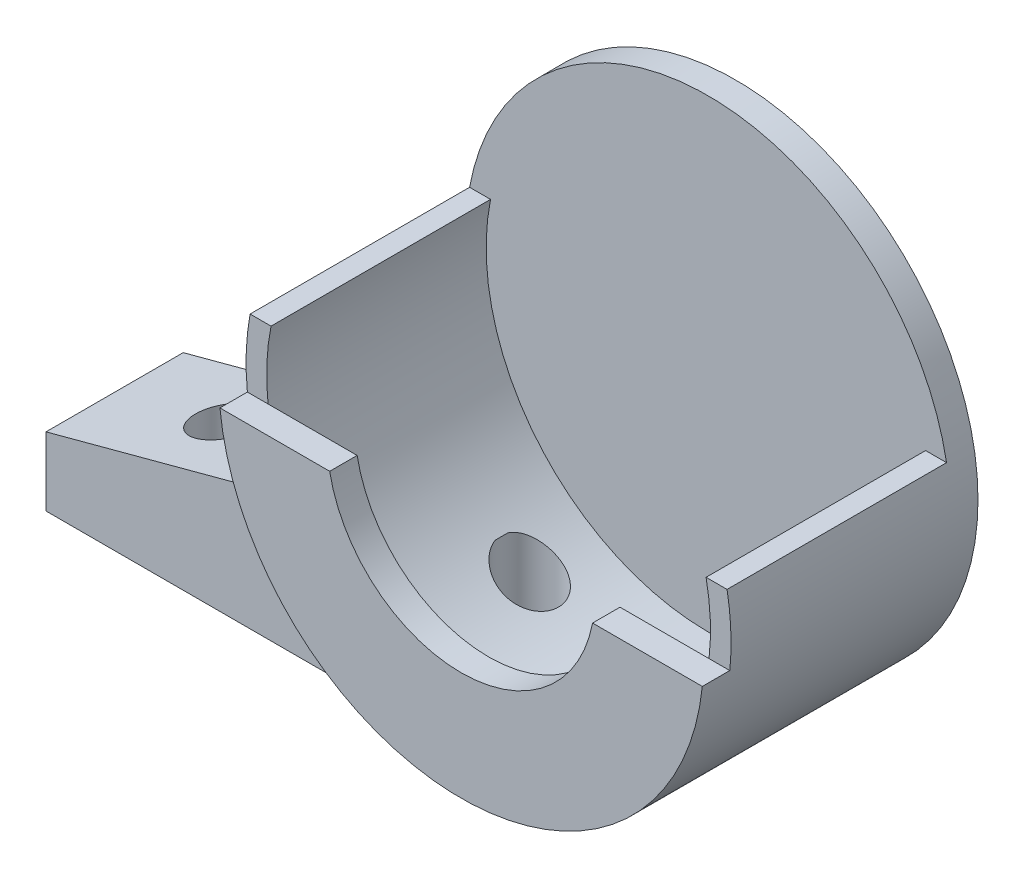
ISO-10303-21;
HEADER;
FILE_DESCRIPTION(('STEP AP214'),'2;1');
FILE_NAME('part.step','',(''),(''),'','','');
FILE_SCHEMA(('AUTOMOTIVE_DESIGN { 1 0 10303 214 1 1 1 1 }'));
ENDSEC;
DATA;
#1=APPLICATION_CONTEXT('core data for automotive mechanical design processes');
#2=APPLICATION_PROTOCOL_DEFINITION('international standard','automotive_design',2000,#1);
#3=PRODUCT_CONTEXT('',#1,'mechanical');
#4=PRODUCT('Part','Part','',(#3));
#5=PRODUCT_RELATED_PRODUCT_CATEGORY('part','',(#4));
#6=PRODUCT_DEFINITION_FORMATION('','',#4);
#7=PRODUCT_DEFINITION_CONTEXT('part definition',#1,'design');
#8=PRODUCT_DEFINITION('design','',#6,#7);
#9=PRODUCT_DEFINITION_SHAPE('','',#8);
#10=(LENGTH_UNIT() NAMED_UNIT(*) SI_UNIT(.MILLI.,.METRE.));
#11=(NAMED_UNIT(*) PLANE_ANGLE_UNIT() SI_UNIT($,.RADIAN.));
#12=(NAMED_UNIT(*) SI_UNIT($,.STERADIAN.) SOLID_ANGLE_UNIT());
#13=UNCERTAINTY_MEASURE_WITH_UNIT(LENGTH_MEASURE(1.E-05),#10,'distance_accuracy_value','');
#14=(GEOMETRIC_REPRESENTATION_CONTEXT(3) GLOBAL_UNCERTAINTY_ASSIGNED_CONTEXT((#13)) GLOBAL_UNIT_ASSIGNED_CONTEXT((#10,
#11,#12)) REPRESENTATION_CONTEXT('',''));
#15=CARTESIAN_POINT('',(0.,0.,0.));
#16=DIRECTION('',(0.,0.,1.));
#17=DIRECTION('',(1.,0.,0.));
#18=AXIS2_PLACEMENT_3D('',#15,#16,#17);
#19=CARTESIAN_POINT('',(0.,0.,-2.));
#20=DIRECTION('',(0.,0.,1.));
#21=DIRECTION('',(1.,0.,0.));
#22=AXIS2_PLACEMENT_3D('',#19,#20,#21);
#23=CYLINDRICAL_SURFACE('',#22,17.675);
#24=CARTESIAN_POINT('',(0.,0.,-2.));
#25=DIRECTION('',(0.,0.,1.));
#26=DIRECTION('',(1.,0.,0.));
#27=AXIS2_PLACEMENT_3D('',#24,#25,#26);
#28=CIRCLE('',#27,17.675);
#29=CARTESIAN_POINT('',(17.675,0.,-2.));
#30=VERTEX_POINT('',#29);
#31=EDGE_CURVE('E271',#30,#30,#28,.T.);
#32=ORIENTED_EDGE('',*,*,#31,.T.);
#33=EDGE_LOOP('',(#32));
#34=FACE_BOUND('',#33,.T.);
#35=DIRECTION('',(0.,0.,-1.));
#36=VECTOR('',#35,1.);
#37=CARTESIAN_POINT('',(-17.3829118676935,3.2,16.));
#38=LINE('',#37,#36);
#39=CARTESIAN_POINT('',(-17.3829118676935,3.2,16.));
#40=VERTEX_POINT('',#39);
#41=CARTESIAN_POINT('',(-17.3829118676935,3.2,10.));
#42=VERTEX_POINT('',#41);
#43=EDGE_CURVE('E274',#40,#42,#38,.T.);
#44=ORIENTED_EDGE('',*,*,#43,.T.);
#45=CARTESIAN_POINT('',(0.,0.,10.));
#46=DIRECTION('',(0.,0.,-1.));
#47=DIRECTION('',(-1.,0.,0.));
#48=AXIS2_PLACEMENT_3D('',#45,#46,#47);
#49=CIRCLE('',#48,17.675);
#50=CARTESIAN_POINT('',(0.,-17.675,10.));
#51=VERTEX_POINT('',#50);
#52=EDGE_CURVE('E195',#51,#42,#49,.T.);
#53=ORIENTED_EDGE('',*,*,#52,.F.);
#54=DIRECTION('',(0.,0.,-1.));
#55=VECTOR('',#54,1.);
#56=CARTESIAN_POINT('',(0.,-17.675,10.));
#57=LINE('',#56,#55);
#58=CARTESIAN_POINT('',(0.,-17.675,0.));
#59=VERTEX_POINT('',#58);
#60=EDGE_CURVE('E302',#51,#59,#57,.T.);
#61=ORIENTED_EDGE('',*,*,#60,.T.);
#62=CARTESIAN_POINT('',(0.,0.,0.));
#63=DIRECTION('',(0.,0.,-1.));
#64=DIRECTION('',(-1.,0.,0.));
#65=AXIS2_PLACEMENT_3D('',#62,#63,#64);
#66=CIRCLE('',#65,17.675);
#67=CARTESIAN_POINT('',(-17.3829118676935,3.2,0.));
#68=VERTEX_POINT('',#67);
#69=EDGE_CURVE('E194',#59,#68,#66,.T.);
#70=ORIENTED_EDGE('',*,*,#69,.T.);
#71=CARTESIAN_POINT('',(0.,0.,0.));
#72=DIRECTION('',(0.,0.,1.));
#73=DIRECTION('',(1.,0.,0.));
#74=AXIS2_PLACEMENT_3D('',#71,#72,#73);
#75=CIRCLE('',#74,17.675);
#76=CARTESIAN_POINT('',(17.3829118676935,3.2,0.));
#77=VERTEX_POINT('',#76);
#78=EDGE_CURVE('E281',#77,#68,#75,.T.);
#79=ORIENTED_EDGE('',*,*,#78,.F.);
#80=DIRECTION('',(0.,0.,-1.));
#81=VECTOR('',#80,1.);
#82=CARTESIAN_POINT('',(17.3829118676935,3.2,16.));
#83=LINE('',#82,#81);
#84=CARTESIAN_POINT('',(17.3829118676935,3.2,16.));
#85=VERTEX_POINT('',#84);
#86=EDGE_CURVE('E282',#85,#77,#83,.T.);
#87=ORIENTED_EDGE('',*,*,#86,.F.);
#88=CARTESIAN_POINT('',(0.,0.,16.));
#89=DIRECTION('',(0.,0.,1.));
#90=DIRECTION('',(1.,0.,0.));
#91=AXIS2_PLACEMENT_3D('',#88,#89,#90);
#92=CIRCLE('',#91,17.675);
#93=CARTESIAN_POINT('',(17.5805290022798,-1.825,16.));
#94=VERTEX_POINT('',#93);
#95=EDGE_CURVE('E345',#94,#85,#92,.T.);
#96=ORIENTED_EDGE('',*,*,#95,.F.);
#97=DIRECTION('',(0.,0.,-1.));
#98=VECTOR('',#97,1.);
#99=CARTESIAN_POINT('',(17.5805290022798,-1.825,18.));
#100=LINE('',#99,#98);
#101=CARTESIAN_POINT('',(17.5805290022798,-1.825,18.));
#102=VERTEX_POINT('',#101);
#103=EDGE_CURVE('E323',#102,#94,#100,.T.);
#104=ORIENTED_EDGE('',*,*,#103,.F.);
#105=CARTESIAN_POINT('',(0.,0.,18.));
#106=DIRECTION('',(0.,0.,1.));
#107=DIRECTION('',(1.,0.,0.));
#108=AXIS2_PLACEMENT_3D('',#105,#106,#107);
#109=CIRCLE('',#108,17.675);
#110=CARTESIAN_POINT('',(-17.5805290022798,-1.825,18.));
#111=VERTEX_POINT('',#110);
#112=EDGE_CURVE('E321',#111,#102,#109,.T.);
#113=ORIENTED_EDGE('',*,*,#112,.F.);
#114=DIRECTION('',(0.,0.,-1.));
#115=VECTOR('',#114,1.);
#116=CARTESIAN_POINT('',(-17.5805290022798,-1.825,18.));
#117=LINE('',#116,#115);
#118=CARTESIAN_POINT('',(-17.5805290022798,-1.825,16.));
#119=VERTEX_POINT('',#118);
#120=EDGE_CURVE('E334',#111,#119,#117,.T.);
#121=ORIENTED_EDGE('',*,*,#120,.T.);
#122=EDGE_CURVE('E277',#40,#119,#92,.T.);
#123=ORIENTED_EDGE('',*,*,#122,.F.);
#124=EDGE_LOOP('',(#44,#53,#61,#70,#79,#87,#96,#104,#113,#121,#123));
#125=FACE_BOUND('',#124,.T.);
#126=ADVANCED_FACE('F42',(#34,#125),#23,.T.);
#127=CARTESIAN_POINT('',(0.,0.,16.));
#128=DIRECTION('',(0.,0.,1.));
#129=DIRECTION('',(1.,0.,0.));
#130=AXIS2_PLACEMENT_3D('',#127,#128,#129);
#131=PLANE('',#130);
#132=ORIENTED_EDGE('',*,*,#122,.T.);
#133=DIRECTION('',(1.,0.,0.));
#134=VECTOR('',#133,1.);
#135=CARTESIAN_POINT('',(0.,-1.825,16.));
#136=LINE('',#135,#134);
#137=CARTESIAN_POINT('',(-16.0717142831747,-1.825,16.));
#138=VERTEX_POINT('',#137);
#139=EDGE_CURVE('E316',#119,#138,#136,.T.);
#140=ORIENTED_EDGE('',*,*,#139,.T.);
#141=CARTESIAN_POINT('',(0.,0.,16.));
#142=DIRECTION('',(0.,0.,1.));
#143=DIRECTION('',(1.,0.,0.));
#144=AXIS2_PLACEMENT_3D('',#141,#142,#143);
#145=CIRCLE('',#144,16.175);
#146=CARTESIAN_POINT('',(-15.8553027407237,3.2,16.));
#147=VERTEX_POINT('',#146);
#148=EDGE_CURVE('E352',#147,#138,#145,.T.);
#149=ORIENTED_EDGE('',*,*,#148,.F.);
#150=DIRECTION('',(1.,0.,0.));
#151=VECTOR('',#150,1.);
#152=CARTESIAN_POINT('',(0.,3.2,16.));
#153=LINE('',#152,#151);
#154=EDGE_CURVE('E343',#40,#147,#153,.T.);
#155=ORIENTED_EDGE('',*,*,#154,.F.);
#156=EDGE_LOOP('',(#132,#140,#149,#155));
#157=FACE_BOUND('',#156,.T.);
#158=ADVANCED_FACE('F253',(#157),#131,.T.);
#159=CARTESIAN_POINT('',(0.,0.,0.));
#160=DIRECTION('',(0.,0.,1.));
#161=DIRECTION('',(1.,0.,0.));
#162=AXIS2_PLACEMENT_3D('',#159,#160,#161);
#163=PLANE('',#162);
#164=ORIENTED_EDGE('',*,*,#78,.T.);
#165=DIRECTION('',(1.,0.,0.));
#166=VECTOR('',#165,1.);
#167=CARTESIAN_POINT('',(0.,3.2,0.));
#168=LINE('',#167,#166);
#169=CARTESIAN_POINT('',(-15.8553027407237,3.2,0.));
#170=VERTEX_POINT('',#169);
#171=EDGE_CURVE('E342',#68,#170,#168,.T.);
#172=ORIENTED_EDGE('',*,*,#171,.T.);
#173=CARTESIAN_POINT('',(0.,0.,0.));
#174=DIRECTION('',(0.,0.,1.));
#175=DIRECTION('',(1.,0.,0.));
#176=AXIS2_PLACEMENT_3D('',#173,#174,#175);
#177=CIRCLE('',#176,16.175);
#178=CARTESIAN_POINT('',(15.8553027407237,3.2,0.));
#179=VERTEX_POINT('',#178);
#180=EDGE_CURVE('E346',#170,#179,#177,.T.);
#181=ORIENTED_EDGE('',*,*,#180,.T.);
#182=DIRECTION('',(1.,0.,0.));
#183=VECTOR('',#182,1.);
#184=CARTESIAN_POINT('',(0.,3.2,0.));
#185=LINE('',#184,#183);
#186=EDGE_CURVE('E359',#179,#77,#185,.T.);
#187=ORIENTED_EDGE('',*,*,#186,.T.);
#188=EDGE_LOOP('',(#164,#172,#181,#187));
#189=FACE_BOUND('',#188,.T.);
#190=ADVANCED_FACE('F261',(#189),#163,.T.);
#191=CARTESIAN_POINT('',(0.,0.,-2.));
#192=DIRECTION('',(0.,0.,1.));
#193=DIRECTION('',(1.,0.,0.));
#194=AXIS2_PLACEMENT_3D('',#191,#192,#193);
#195=PLANE('',#194);
#196=ORIENTED_EDGE('',*,*,#31,.F.);
#197=EDGE_LOOP('',(#196));
#198=FACE_BOUND('',#197,.T.);
#199=ADVANCED_FACE('F419',(#198),#195,.F.);
#200=CARTESIAN_POINT('',(0.,3.2,16.));
#201=DIRECTION('',(0.,1.,0.));
#202=DIRECTION('',(0.,0.,1.));
#203=AXIS2_PLACEMENT_3D('',#200,#201,#202);
#204=PLANE('',#203);
#205=ORIENTED_EDGE('',*,*,#171,.F.);
#206=DIRECTION('',(0.,0.,-1.));
#207=VECTOR('',#206,1.);
#208=CARTESIAN_POINT('',(-17.3829118676935,3.2,10.));
#209=LINE('',#208,#207);
#210=EDGE_CURVE('E286',#42,#68,#209,.T.);
#211=ORIENTED_EDGE('',*,*,#210,.F.);
#212=ORIENTED_EDGE('',*,*,#43,.F.);
#213=ORIENTED_EDGE('',*,*,#154,.T.);
#214=DIRECTION('',(0.,0.,-1.));
#215=VECTOR('',#214,1.);
#216=CARTESIAN_POINT('',(-15.8553027407237,3.2,16.));
#217=LINE('',#216,#215);
#218=EDGE_CURVE('E355',#147,#170,#217,.T.);
#219=ORIENTED_EDGE('',*,*,#218,.T.);
#220=EDGE_LOOP('',(#205,#211,#212,#213,#219));
#221=FACE_BOUND('',#220,.T.);
#222=ADVANCED_FACE('F397',(#221),#204,.T.);
#223=CARTESIAN_POINT('',(0.,3.2,16.));
#224=DIRECTION('',(0.,1.,0.));
#225=DIRECTION('',(0.,0.,1.));
#226=AXIS2_PLACEMENT_3D('',#223,#224,#225);
#227=PLANE('',#226);
#228=ORIENTED_EDGE('',*,*,#186,.F.);
#229=DIRECTION('',(0.,0.,-1.));
#230=VECTOR('',#229,1.);
#231=CARTESIAN_POINT('',(15.8553027407237,3.2,16.));
#232=LINE('',#231,#230);
#233=CARTESIAN_POINT('',(15.8553027407237,3.2,16.));
#234=VERTEX_POINT('',#233);
#235=EDGE_CURVE('E365',#234,#179,#232,.T.);
#236=ORIENTED_EDGE('',*,*,#235,.F.);
#237=DIRECTION('',(1.,0.,0.));
#238=VECTOR('',#237,1.);
#239=CARTESIAN_POINT('',(0.,3.2,16.));
#240=LINE('',#239,#238);
#241=EDGE_CURVE('E348',#234,#85,#240,.T.);
#242=ORIENTED_EDGE('',*,*,#241,.T.);
#243=ORIENTED_EDGE('',*,*,#86,.T.);
#244=EDGE_LOOP('',(#228,#236,#242,#243));
#245=FACE_BOUND('',#244,.T.);
#246=ADVANCED_FACE('F258',(#245),#227,.T.);
#247=CARTESIAN_POINT('',(0.,0.,16.));
#248=DIRECTION('',(0.,0.,-1.));
#249=DIRECTION('',(-1.,0.,0.));
#250=AXIS2_PLACEMENT_3D('',#247,#248,#249);
#251=CYLINDRICAL_SURFACE('',#250,16.175);
#252=CARTESIAN_POINT('',(-10.048631747656,-12.675,5.46163617979522));
#253=CARTESIAN_POINT('',(-10.0362516888631,-12.6848129137088,5.5165961726147));
#254=CARTESIAN_POINT('',(-10.0217263107842,-12.6963009149049,5.57072035074416));
#255=CARTESIAN_POINT('',(-9.98868659198187,-12.7223118607582,5.67691275310043));
#256=CARTESIAN_POINT('',(-9.9701771969836,-12.736831041868,5.72898343254237));
#257=CARTESIAN_POINT('',(-9.90941090852277,-12.7842408499664,5.88088907773259));
#258=CARTESIAN_POINT('',(-9.86169907250108,-12.8211581282036,5.97734622583838));
#259=CARTESIAN_POINT('',(-9.75447924912679,-12.9029171374966,6.15883127025488));
#260=CARTESIAN_POINT('',(-9.69502803602825,-12.9477206200627,6.24391099247536));
#261=CARTESIAN_POINT('',(-9.56616653346665,-13.0432178742171,6.40271138747403));
#262=CARTESIAN_POINT('',(-9.49673416623826,-13.0939246550074,6.47640610703256));
#263=CARTESIAN_POINT('',(-9.33817907905768,-13.2075722390843,6.62254774278101));
#264=CARTESIAN_POINT('',(-9.24767713645219,-13.2711826554748,6.69297397040973));
#265=CARTESIAN_POINT('',(-9.05805194575909,-13.4013272149908,6.81752647887265));
#266=CARTESIAN_POINT('',(-8.95892717887507,-13.4678618721572,6.87164988065719));
#267=CARTESIAN_POINT('',(-8.73649680443305,-13.6134026273834,6.97099213212301));
#268=CARTESIAN_POINT('',(-8.61194136564355,-13.6926100696929,7.01314395935503));
#269=CARTESIAN_POINT('',(-8.35647233692374,-13.8500012162047,7.0736854854517));
#270=CARTESIAN_POINT('',(-8.22555498775408,-13.9281842795974,7.0920609533289));
#271=CARTESIAN_POINT('',(-7.95472325823726,-14.0846902377882,7.10407221091292));
#272=CARTESIAN_POINT('',(-7.81466773682539,-14.1628645902611,7.09657091815702));
#273=CARTESIAN_POINT('',(-7.53575039709634,-14.3132159536639,7.05289211110297));
#274=CARTESIAN_POINT('',(-7.39688808349011,-14.3853955726454,7.01672714010922));
#275=CARTESIAN_POINT('',(-7.13609163323436,-14.5164230880771,6.91874835852333));
#276=CARTESIAN_POINT('',(-7.01366708889095,-14.5758635972584,6.85904628376781));
#277=CARTESIAN_POINT('',(-6.78002186035509,-14.6859997274061,6.71477403039394));
#278=CARTESIAN_POINT('',(-6.6687911050338,-14.7367032389053,6.63022647886721));
#279=CARTESIAN_POINT('',(-6.47556676653083,-14.8225342376308,6.44964116531125));
#280=CARTESIAN_POINT('',(-6.39166810619524,-14.8587985309505,6.35617954552848));
#281=CARTESIAN_POINT('',(-6.24088264025845,-14.9227588776094,6.15385741965679));
#282=CARTESIAN_POINT('',(-6.17398476786098,-14.9504605074356,6.04500700322804));
#283=CARTESIAN_POINT('',(-6.06596427207527,-14.9945921324645,5.82639947985921));
#284=CARTESIAN_POINT('',(-6.02299180067318,-15.0118452038745,5.71771909903666));
#285=CARTESIAN_POINT('',(-5.95555871452224,-15.0387259652128,5.49386831104401));
#286=CARTESIAN_POINT('',(-5.93109152203244,-15.0483563646927,5.3787002255975));
#287=CARTESIAN_POINT('',(-5.90250497354638,-15.0595910061962,5.15150441327436));
#288=CARTESIAN_POINT('',(-5.89740869352373,-15.0615806476504,5.03961744474287));
#289=CARTESIAN_POINT('',(-5.90505461404639,-15.05858468899,4.81655725440867));
#290=CARTESIAN_POINT('',(-5.9177943640437,-15.0536000470941,4.70538393666335));
#291=CARTESIAN_POINT('',(-5.96029026535997,-15.0368237772254,4.48850442102385));
#292=CARTESIAN_POINT('',(-5.9898069550404,-15.0251279182543,4.38274364543951));
#293=CARTESIAN_POINT('',(-6.06452092149655,-14.9951265688516,4.1779261303926));
#294=CARTESIAN_POINT('',(-6.10971851586544,-14.9768209445488,4.07886952676153));
#295=CARTESIAN_POINT('',(-6.21499902917407,-14.9334421414549,3.88832394876872));
#296=CARTESIAN_POINT('',(-6.27532584451873,-14.9082574052653,3.796995464687));
#297=CARTESIAN_POINT('',(-6.4082254452286,-14.8516153547502,3.62595817275173));
#298=CARTESIAN_POINT('',(-6.48080019871986,-14.8201570321718,3.54625123621227));
#299=CARTESIAN_POINT('',(-6.63955819838029,-14.7497383205867,3.39634926530015));
#300=CARTESIAN_POINT('',(-6.72623608718641,-14.7104844459828,3.32681726129478));
#301=CARTESIAN_POINT('',(-6.90745911540343,-14.6262647796907,3.20322573405507));
#302=CARTESIAN_POINT('',(-7.00200664673921,-14.5812972491725,3.14917093734197));
#303=CARTESIAN_POINT('',(-7.20426800665308,-14.4825004561167,3.05311549452699));
#304=CARTESIAN_POINT('',(-7.31242354924379,-14.4282455898282,3.01248564625041));
#305=CARTESIAN_POINT('',(-7.53159729782719,-14.3150587629079,2.94972879559315));
#306=CARTESIAN_POINT('',(-7.64261676584879,-14.2561247157134,2.92761009910797));
#307=CARTESIAN_POINT('',(-7.87686050493986,-14.1281756393742,2.89995135908797));
#308=CARTESIAN_POINT('',(-8.00010751577512,-14.0587593717028,2.89646061459491));
#309=CARTESIAN_POINT('',(-8.2437997402252,-13.9172656690895,2.91062759724677));
#310=CARTESIAN_POINT('',(-8.36424403754765,-13.8451873832368,2.92829214436111));
#311=CARTESIAN_POINT('',(-8.61164614489886,-13.6928197936103,2.98663922804937));
#312=CARTESIAN_POINT('',(-8.73804498049989,-13.6124322509826,3.02945342317702));
#313=CARTESIAN_POINT('',(-8.98150273644574,-13.4530462937755,3.1386859678182));
#314=CARTESIAN_POINT('',(-9.09854606734599,-13.3740503620611,3.20514274945725));
#315=CARTESIAN_POINT('',(-9.32293154015116,-13.2186493050989,3.3631724675322));
#316=CARTESIAN_POINT('',(-9.4299171768914,-13.142375687196,3.45538744603142));
#317=CARTESIAN_POINT('',(-9.62566968867642,-12.9996806526701,3.66305226641289));
#318=CARTESIAN_POINT('',(-9.71452145600231,-12.9332137520687,3.77838858654647));
#319=CARTESIAN_POINT('',(-9.84932674868981,-12.8306932802728,3.99890982683605));
#320=CARTESIAN_POINT('',(-9.90044674541568,-12.7911987855231,4.09929299443132));
#321=CARTESIAN_POINT('',(-9.96537364256627,-12.7405933345856,4.25796329171526));
#322=CARTESIAN_POINT('',(-9.98512132211305,-12.7251125074176,4.31247638999187));
#323=CARTESIAN_POINT('',(-10.0202517417155,-12.6974669947888,4.42380423893603));
#324=CARTESIAN_POINT('',(-10.0356272526248,-12.6853078027635,4.48062262609606));
#325=CARTESIAN_POINT('',(-10.048631747656,-12.675,4.53836382020478));
#326=B_SPLINE_CURVE_WITH_KNOTS('',3,(#252,#253,#254,#255,#256,#257,#258,#259,#260,#261,#262,
#263,#264,#265,#266,#267,#268,#269,#270,#271,#272,#273,#274,#275,#276,#277,#278,#279,#280,#281,
#282,#283,#284,#285,#286,#287,#288,#289,#290,#291,#292,#293,#294,#295,#296,#297,#298,#299,#300,
#301,#302,#303,#304,#305,#306,#307,#308,#309,#310,#311,#312,#313,#314,#315,#316,#317,#318,#319,
#320,#321,#322,#323,#324,#325),.UNSPECIFIED.,.F.,.F.,(4,2,2,2,2,2,2,2,2,2,2,2,2,2,2,2,2,2,2,2,2,
2,2,2,2,2,2,2,2,2,2,2,2,2,2,2,4),(0.,0.17139787447373,0.342584191729229,0.68209300046594,
1.019998399575,1.35866306829623,1.75061298473828,2.14263207830257,2.60113755583815,
3.05991733827833,3.53910897273777,4.01809102732107,4.46138625435334,4.9042790113639,
5.29430616131825,5.68407876591206,6.03667492692313,6.38914569789686,6.72358470005958,
7.05797775710995,7.38771366048489,7.71745624255516,8.05290108117809,8.38839987397961,
8.74044583850302,9.09259919851963,9.47394644095163,9.85546470109067,10.278201439527,
10.7010744950569,11.1663760747364,11.632437506045,12.1113505062335,12.5879673098077,
12.9441237772918,13.1238884279807,13.3039486041718),.UNSPECIFIED.);
#327=CARTESIAN_POINT('',(-10.048631747656,-12.675,5.46163617979522));
#328=VERTEX_POINT('',#327);
#329=CARTESIAN_POINT('',(-10.048631747656,-12.675,4.53836382020478));
#330=VERTEX_POINT('',#329);
#331=EDGE_CURVE('E185',#328,#330,#326,.T.);
#332=ORIENTED_EDGE('',*,*,#331,.F.);
#333=DIRECTION('',(0.,0.,-1.));
#334=VECTOR('',#333,1.);
#335=CARTESIAN_POINT('',(-10.048631747656,-12.675,16.));
#336=LINE('',#335,#334);
#337=EDGE_CURVE('E49',#328,#330,#336,.T.);
#338=ORIENTED_EDGE('',*,*,#337,.T.);
#339=EDGE_LOOP('',(#332,#338));
#340=FACE_BOUND('',#339,.T.);
#341=ORIENTED_EDGE('',*,*,#180,.F.);
#342=ORIENTED_EDGE('',*,*,#218,.F.);
#343=ORIENTED_EDGE('',*,*,#148,.T.);
#344=CARTESIAN_POINT('',(16.0717142831747,-1.825,16.));
#345=VERTEX_POINT('',#344);
#346=EDGE_CURVE('E356',#138,#345,#145,.T.);
#347=ORIENTED_EDGE('',*,*,#346,.T.);
#348=EDGE_CURVE('E351',#345,#234,#145,.T.);
#349=ORIENTED_EDGE('',*,*,#348,.T.);
#350=ORIENTED_EDGE('',*,*,#235,.T.);
#351=EDGE_LOOP('',(#341,#342,#343,#347,#349,#350));
#352=FACE_BOUND('',#351,.T.);
#353=ADVANCED_FACE('F197',(#340,#352),#251,.F.);
#354=DIRECTION('',(-1.,0.,0.));
#355=VECTOR('',#354,1.);
#356=CARTESIAN_POINT('',(0.,-1.825,16.));
#357=LINE('',#356,#355);
#358=EDGE_CURVE('E324',#94,#345,#357,.T.);
#359=ORIENTED_EDGE('',*,*,#358,.F.);
#360=ORIENTED_EDGE('',*,*,#95,.T.);
#361=ORIENTED_EDGE('',*,*,#241,.F.);
#362=ORIENTED_EDGE('',*,*,#348,.F.);
#363=EDGE_LOOP('',(#359,#360,#361,#362));
#364=FACE_BOUND('',#363,.T.);
#365=ADVANCED_FACE('F249',(#364),#131,.T.);
#366=CARTESIAN_POINT('',(0.,-1.825,18.));
#367=DIRECTION('',(0.,-1.,0.));
#368=DIRECTION('',(1.,0.,0.));
#369=AXIS2_PLACEMENT_3D('',#366,#367,#368);
#370=PLANE('',#369);
#371=ORIENTED_EDGE('',*,*,#358,.T.);
#372=CARTESIAN_POINT('',(9.58052900227976,-1.825,16.));
#373=VERTEX_POINT('',#372);
#374=EDGE_CURVE('E311',#345,#373,#357,.T.);
#375=ORIENTED_EDGE('',*,*,#374,.T.);
#376=DIRECTION('',(0.,0.,-1.));
#377=VECTOR('',#376,1.);
#378=CARTESIAN_POINT('',(9.58052900227976,-1.825,18.));
#379=LINE('',#378,#377);
#380=CARTESIAN_POINT('',(9.58052900227976,-1.825,18.));
#381=VERTEX_POINT('',#380);
#382=EDGE_CURVE('E339',#381,#373,#379,.T.);
#383=ORIENTED_EDGE('',*,*,#382,.F.);
#384=DIRECTION('',(-1.,0.,0.));
#385=VECTOR('',#384,1.);
#386=CARTESIAN_POINT('',(0.,-1.825,18.));
#387=LINE('',#386,#385);
#388=EDGE_CURVE('E312',#102,#381,#387,.T.);
#389=ORIENTED_EDGE('',*,*,#388,.F.);
#390=ORIENTED_EDGE('',*,*,#103,.T.);
#391=EDGE_LOOP('',(#371,#375,#383,#389,#390));
#392=FACE_BOUND('',#391,.T.);
#393=ADVANCED_FACE('F246',(#392),#370,.F.);
#394=CARTESIAN_POINT('',(0.,0.,18.));
#395=DIRECTION('',(0.,0.,-1.));
#396=DIRECTION('',(-1.,0.,0.));
#397=AXIS2_PLACEMENT_3D('',#394,#395,#396);
#398=CYLINDRICAL_SURFACE('',#397,9.75280272350075);
#399=CARTESIAN_POINT('',(0.,0.,16.));
#400=DIRECTION('',(0.,0.,1.));
#401=DIRECTION('',(1.,0.,0.));
#402=AXIS2_PLACEMENT_3D('',#399,#400,#401);
#403=CIRCLE('',#402,9.75280272350075);
#404=CARTESIAN_POINT('',(-9.58052900227976,-1.825,16.));
#405=VERTEX_POINT('',#404);
#406=EDGE_CURVE('E327',#373,#405,#403,.F.);
#407=ORIENTED_EDGE('',*,*,#406,.T.);
#408=DIRECTION('',(0.,0.,-1.));
#409=VECTOR('',#408,1.);
#410=CARTESIAN_POINT('',(-9.58052900227976,-1.825,18.));
#411=LINE('',#410,#409);
#412=CARTESIAN_POINT('',(-9.58052900227976,-1.825,18.));
#413=VERTEX_POINT('',#412);
#414=EDGE_CURVE('E336',#413,#405,#411,.T.);
#415=ORIENTED_EDGE('',*,*,#414,.F.);
#416=CARTESIAN_POINT('',(0.,0.,18.));
#417=DIRECTION('',(0.,0.,1.));
#418=DIRECTION('',(1.,0.,0.));
#419=AXIS2_PLACEMENT_3D('',#416,#417,#418);
#420=CIRCLE('',#419,9.75280272350075);
#421=EDGE_CURVE('E315',#381,#413,#420,.F.);
#422=ORIENTED_EDGE('',*,*,#421,.F.);
#423=ORIENTED_EDGE('',*,*,#382,.T.);
#424=EDGE_LOOP('',(#407,#415,#422,#423));
#425=FACE_BOUND('',#424,.T.);
#426=ADVANCED_FACE('F242',(#425),#398,.F.);
#427=CARTESIAN_POINT('',(0.,-1.825,18.));
#428=DIRECTION('',(0.,1.,0.));
#429=DIRECTION('',(-1.,0.,0.));
#430=AXIS2_PLACEMENT_3D('',#427,#428,#429);
#431=PLANE('',#430);
#432=ORIENTED_EDGE('',*,*,#139,.F.);
#433=ORIENTED_EDGE('',*,*,#120,.F.);
#434=DIRECTION('',(1.,0.,0.));
#435=VECTOR('',#434,1.);
#436=CARTESIAN_POINT('',(0.,-1.825,18.));
#437=LINE('',#436,#435);
#438=EDGE_CURVE('E318',#111,#413,#437,.T.);
#439=ORIENTED_EDGE('',*,*,#438,.T.);
#440=ORIENTED_EDGE('',*,*,#414,.T.);
#441=EDGE_CURVE('E330',#138,#405,#136,.T.);
#442=ORIENTED_EDGE('',*,*,#441,.F.);
#443=EDGE_LOOP('',(#432,#433,#439,#440,#442));
#444=FACE_BOUND('',#443,.T.);
#445=ADVANCED_FACE('F235',(#444),#431,.T.);
#446=CARTESIAN_POINT('',(0.,0.,18.));
#447=DIRECTION('',(0.,0.,1.));
#448=DIRECTION('',(1.,0.,0.));
#449=AXIS2_PLACEMENT_3D('',#446,#447,#448);
#450=PLANE('',#449);
#451=ORIENTED_EDGE('',*,*,#388,.T.);
#452=ORIENTED_EDGE('',*,*,#421,.T.);
#453=ORIENTED_EDGE('',*,*,#438,.F.);
#454=ORIENTED_EDGE('',*,*,#112,.T.);
#455=EDGE_LOOP('',(#451,#452,#453,#454));
#456=FACE_BOUND('',#455,.T.);
#457=ADVANCED_FACE('F232',(#456),#450,.T.);
#458=CARTESIAN_POINT('',(0.,0.,16.));
#459=DIRECTION('',(0.,0.,1.));
#460=DIRECTION('',(1.,0.,0.));
#461=AXIS2_PLACEMENT_3D('',#458,#459,#460);
#462=PLANE('',#461);
#463=ORIENTED_EDGE('',*,*,#346,.F.);
#464=ORIENTED_EDGE('',*,*,#441,.T.);
#465=ORIENTED_EDGE('',*,*,#406,.F.);
#466=ORIENTED_EDGE('',*,*,#374,.F.);
#467=EDGE_LOOP('',(#463,#464,#465,#466));
#468=FACE_BOUND('',#467,.T.);
#469=ADVANCED_FACE('F230',(#468),#462,.F.);
#470=CARTESIAN_POINT('',(-38.2579118676937,-17.675,10.));
#471=DIRECTION('',(0.707106781186544,-0.707106781186551,0.));
#472=DIRECTION('',(0.707106781186551,0.707106781186544,0.));
#473=AXIS2_PLACEMENT_3D('',#470,#471,#472);
#474=PLANE('',#473);
#475=DIRECTION('',(-0.707106781186551,-0.707106781186544,0.));
#476=VECTOR('',#475,1.);
#477=CARTESIAN_POINT('',(-38.2579118676937,-17.675,0.));
#478=LINE('',#477,#476);
#479=CARTESIAN_POINT('',(-18.3829118676935,2.2,0.));
#480=VERTEX_POINT('',#479);
#481=EDGE_CURVE('E379',#68,#480,#478,.T.);
#482=ORIENTED_EDGE('',*,*,#481,.T.);
#483=DIRECTION('',(0.,0.,1.));
#484=VECTOR('',#483,1.);
#485=CARTESIAN_POINT('',(-18.3829118676935,2.2,-2.));
#486=LINE('',#485,#484);
#487=CARTESIAN_POINT('',(-18.3829118676935,2.2,10.));
#488=VERTEX_POINT('',#487);
#489=EDGE_CURVE('E169',#480,#488,#486,.T.);
#490=ORIENTED_EDGE('',*,*,#489,.T.);
#491=DIRECTION('',(-0.707106781186551,-0.707106781186544,0.));
#492=VECTOR('',#491,1.);
#493=CARTESIAN_POINT('',(-38.2579118676937,-17.675,10.));
#494=LINE('',#493,#492);
#495=EDGE_CURVE('E175',#42,#488,#494,.T.);
#496=ORIENTED_EDGE('',*,*,#495,.F.);
#497=ORIENTED_EDGE('',*,*,#210,.T.);
#498=EDGE_LOOP('',(#482,#490,#496,#497));
#499=FACE_BOUND('',#498,.T.);
#500=ADVANCED_FACE('F226',(#499),#474,.F.);
#501=CARTESIAN_POINT('',(-38.2579118676937,-17.675,10.));
#502=DIRECTION('',(1.,0.,0.));
#503=DIRECTION('',(0.,0.,-1.));
#504=AXIS2_PLACEMENT_3D('',#501,#502,#503);
#505=PLANE('',#504);
#506=DIRECTION('',(0.,-1.,0.));
#507=VECTOR('',#506,1.);
#508=CARTESIAN_POINT('',(-38.2579118676937,-17.675,0.));
#509=LINE('',#508,#507);
#510=CARTESIAN_POINT('',(-38.2579118676937,-17.675,0.));
#511=VERTEX_POINT('',#510);
#512=CARTESIAN_POINT('',(-38.2579118676937,-22.675,0.));
#513=VERTEX_POINT('',#512);
#514=EDGE_CURVE('E298',#511,#513,#509,.T.);
#515=ORIENTED_EDGE('',*,*,#514,.T.);
#516=DIRECTION('',(0.,0.,-1.));
#517=VECTOR('',#516,1.);
#518=CARTESIAN_POINT('',(-38.2579118676937,-22.675,10.));
#519=LINE('',#518,#517);
#520=CARTESIAN_POINT('',(-38.2579118676937,-22.675,10.));
#521=VERTEX_POINT('',#520);
#522=EDGE_CURVE('E306',#521,#513,#519,.T.);
#523=ORIENTED_EDGE('',*,*,#522,.F.);
#524=DIRECTION('',(0.,-1.,0.));
#525=VECTOR('',#524,1.);
#526=CARTESIAN_POINT('',(-38.2579118676937,-17.675,10.));
#527=LINE('',#526,#525);
#528=CARTESIAN_POINT('',(-38.2579118676937,-17.675,10.));
#529=VERTEX_POINT('',#528);
#530=EDGE_CURVE('E287',#529,#521,#527,.T.);
#531=ORIENTED_EDGE('',*,*,#530,.F.);
#532=DIRECTION('',(0.,0.,-1.));
#533=VECTOR('',#532,1.);
#534=CARTESIAN_POINT('',(-38.2579118676937,-17.675,10.));
#535=LINE('',#534,#533);
#536=EDGE_CURVE('E157',#529,#511,#535,.T.);
#537=ORIENTED_EDGE('',*,*,#536,.T.);
#538=EDGE_LOOP('',(#515,#523,#531,#537));
#539=FACE_BOUND('',#538,.T.);
#540=ADVANCED_FACE('F222',(#539),#505,.F.);
#541=CARTESIAN_POINT('',(-38.2579118676937,-22.675,10.));
#542=DIRECTION('',(0.,1.,0.));
#543=DIRECTION('',(-1.,0.,0.));
#544=AXIS2_PLACEMENT_3D('',#541,#542,#543);
#545=PLANE('',#544);
#546=CARTESIAN_POINT('',(-30.2579118676937,-22.675,5.));
#547=DIRECTION('',(0.,-1.,0.));
#548=DIRECTION('',(0.,0.,-1.));
#549=AXIS2_PLACEMENT_3D('',#546,#547,#548);
#550=CIRCLE('',#549,2.1);
#551=CARTESIAN_POINT('',(-30.2579118676937,-22.675,2.9));
#552=VERTEX_POINT('',#551);
#553=EDGE_CURVE('E182',#552,#552,#550,.T.);
#554=ORIENTED_EDGE('',*,*,#553,.F.);
#555=EDGE_LOOP('',(#554));
#556=FACE_BOUND('',#555,.T.);
#557=CARTESIAN_POINT('',(-8.,-22.675,5.));
#558=DIRECTION('',(0.,-1.,0.));
#559=DIRECTION('',(0.,0.,-1.));
#560=AXIS2_PLACEMENT_3D('',#557,#558,#559);
#561=CIRCLE('',#560,2.1);
#562=CARTESIAN_POINT('',(-8.,-22.675,2.9));
#563=VERTEX_POINT('',#562);
#564=EDGE_CURVE('E176',#563,#563,#561,.T.);
#565=ORIENTED_EDGE('',*,*,#564,.F.);
#566=EDGE_LOOP('',(#565));
#567=FACE_BOUND('',#566,.T.);
#568=DIRECTION('',(1.,0.,0.));
#569=VECTOR('',#568,1.);
#570=CARTESIAN_POINT('',(-38.2579118676937,-22.675,0.));
#571=LINE('',#570,#569);
#572=CARTESIAN_POINT('',(0.,-22.675,0.));
#573=VERTEX_POINT('',#572);
#574=EDGE_CURVE('E293',#513,#573,#571,.T.);
#575=ORIENTED_EDGE('',*,*,#574,.T.);
#576=DIRECTION('',(0.,0.,-1.));
#577=VECTOR('',#576,1.);
#578=CARTESIAN_POINT('',(0.,-22.675,10.));
#579=LINE('',#578,#577);
#580=CARTESIAN_POINT('',(0.,-22.675,10.));
#581=VERTEX_POINT('',#580);
#582=EDGE_CURVE('E304',#581,#573,#579,.T.);
#583=ORIENTED_EDGE('',*,*,#582,.F.);
#584=DIRECTION('',(1.,0.,0.));
#585=VECTOR('',#584,1.);
#586=CARTESIAN_POINT('',(-38.2579118676937,-22.675,10.));
#587=LINE('',#586,#585);
#588=EDGE_CURVE('E385',#521,#581,#587,.T.);
#589=ORIENTED_EDGE('',*,*,#588,.F.);
#590=ORIENTED_EDGE('',*,*,#522,.T.);
#591=EDGE_LOOP('',(#575,#583,#589,#590));
#592=FACE_BOUND('',#591,.T.);
#593=ADVANCED_FACE('F218',(#556,#567,#592),#545,.F.);
#594=CARTESIAN_POINT('',(0.,-22.675,10.));
#595=DIRECTION('',(-1.,0.,0.));
#596=DIRECTION('',(0.,0.,1.));
#597=AXIS2_PLACEMENT_3D('',#594,#595,#596);
#598=PLANE('',#597);
#599=DIRECTION('',(0.,1.,0.));
#600=VECTOR('',#599,1.);
#601=CARTESIAN_POINT('',(0.,-22.675,0.));
#602=LINE('',#601,#600);
#603=EDGE_CURVE('E291',#573,#59,#602,.T.);
#604=ORIENTED_EDGE('',*,*,#603,.T.);
#605=ORIENTED_EDGE('',*,*,#60,.F.);
#606=DIRECTION('',(0.,1.,0.));
#607=VECTOR('',#606,1.);
#608=CARTESIAN_POINT('',(0.,-22.675,10.));
#609=LINE('',#608,#607);
#610=EDGE_CURVE('E289',#581,#51,#609,.T.);
#611=ORIENTED_EDGE('',*,*,#610,.F.);
#612=ORIENTED_EDGE('',*,*,#582,.T.);
#613=EDGE_LOOP('',(#604,#605,#611,#612));
#614=FACE_BOUND('',#613,.T.);
#615=ADVANCED_FACE('F212',(#614),#598,.F.);
#616=CARTESIAN_POINT('',(0.,0.,10.));
#617=DIRECTION('',(0.,0.,-1.));
#618=DIRECTION('',(-1.,0.,0.));
#619=AXIS2_PLACEMENT_3D('',#616,#617,#618);
#620=PLANE('',#619);
#621=ORIENTED_EDGE('',*,*,#495,.T.);
#622=DIRECTION('',(-0.258819045102521,-0.965925826289068,0.));
#623=VECTOR('',#622,1.);
#624=CARTESIAN_POINT('',(-17.7014902703233,4.74310002276051,10.));
#625=LINE('',#624,#623);
#626=CARTESIAN_POINT('',(-22.5829935676216,-13.4749183000718,10.));
#627=VERTEX_POINT('',#626);
#628=EDGE_CURVE('E161',#488,#627,#625,.T.);
#629=ORIENTED_EDGE('',*,*,#628,.T.);
#630=DIRECTION('',(-0.965925826289067,-0.258819045102525,0.));
#631=VECTOR('',#630,1.);
#632=CARTESIAN_POINT('',(1.85595585273759,-6.92652153902137,10.));
#633=LINE('',#632,#631);
#634=EDGE_CURVE('E154',#627,#529,#633,.T.);
#635=ORIENTED_EDGE('',*,*,#634,.T.);
#636=ORIENTED_EDGE('',*,*,#530,.T.);
#637=ORIENTED_EDGE('',*,*,#588,.T.);
#638=ORIENTED_EDGE('',*,*,#610,.T.);
#639=ORIENTED_EDGE('',*,*,#52,.T.);
#640=EDGE_LOOP('',(#621,#629,#635,#636,#637,#638,#639));
#641=FACE_BOUND('',#640,.T.);
#642=ADVANCED_FACE('F172',(#641),#620,.F.);
#643=CARTESIAN_POINT('',(0.,0.,0.));
#644=DIRECTION('',(0.,0.,-1.));
#645=DIRECTION('',(-1.,0.,0.));
#646=AXIS2_PLACEMENT_3D('',#643,#644,#645);
#647=PLANE('',#646);
#648=DIRECTION('',(-0.258819045102521,-0.965925826289068,0.));
#649=VECTOR('',#648,1.);
#650=CARTESIAN_POINT('',(-17.7014902703233,4.74310002276051,0.));
#651=LINE('',#650,#649);
#652=CARTESIAN_POINT('',(-22.5829935676216,-13.4749183000718,0.));
#653=VERTEX_POINT('',#652);
#654=EDGE_CURVE('E11',#480,#653,#651,.T.);
#655=ORIENTED_EDGE('',*,*,#654,.F.);
#656=ORIENTED_EDGE('',*,*,#481,.F.);
#657=ORIENTED_EDGE('',*,*,#69,.F.);
#658=ORIENTED_EDGE('',*,*,#603,.F.);
#659=ORIENTED_EDGE('',*,*,#574,.F.);
#660=ORIENTED_EDGE('',*,*,#514,.F.);
#661=DIRECTION('',(-0.965925826289067,-0.258819045102525,0.));
#662=VECTOR('',#661,1.);
#663=CARTESIAN_POINT('',(1.85595585273759,-6.92652153902137,0.));
#664=LINE('',#663,#662);
#665=EDGE_CURVE('E162',#653,#511,#664,.T.);
#666=ORIENTED_EDGE('',*,*,#665,.F.);
#667=EDGE_LOOP('',(#655,#656,#657,#658,#659,#660,#666));
#668=FACE_BOUND('',#667,.T.);
#669=ADVANCED_FACE('F207',(#668),#647,.T.);
#670=CARTESIAN_POINT('',(-8.,-12.675,5.));
#671=DIRECTION('',(0.,-1.,0.));
#672=DIRECTION('',(0.,0.,-1.));
#673=AXIS2_PLACEMENT_3D('',#670,#671,#672);
#674=CYLINDRICAL_SURFACE('',#673,2.1);
#675=ORIENTED_EDGE('',*,*,#331,.T.);
#676=CARTESIAN_POINT('',(-8.,-12.675,5.));
#677=DIRECTION('',(0.,-1.,0.));
#678=DIRECTION('',(0.,0.,-1.));
#679=AXIS2_PLACEMENT_3D('',#676,#677,#678);
#680=CIRCLE('',#679,2.1);
#681=EDGE_CURVE('E62',#328,#330,#680,.T.);
#682=ORIENTED_EDGE('',*,*,#681,.F.);
#683=EDGE_LOOP('',(#675,#682));
#684=FACE_BOUND('',#683,.T.);
#685=ORIENTED_EDGE('',*,*,#564,.T.);
#686=EDGE_LOOP('',(#685));
#687=FACE_BOUND('',#686,.T.);
#688=ADVANCED_FACE('F201',(#684,#687),#674,.F.);
#689=CARTESIAN_POINT('',(0.,-12.675,0.));
#690=DIRECTION('',(0.,-1.,0.));
#691=DIRECTION('',(0.,0.,-1.));
#692=AXIS2_PLACEMENT_3D('',#689,#690,#691);
#693=PLANE('',#692);
#694=ORIENTED_EDGE('',*,*,#681,.T.);
#695=ORIENTED_EDGE('',*,*,#337,.F.);
#696=EDGE_LOOP('',(#694,#695));
#697=FACE_BOUND('',#696,.T.);
#698=ADVANCED_FACE('F206',(#697),#693,.T.);
#699=CARTESIAN_POINT('',(-30.2579118676937,-12.675,5.));
#700=DIRECTION('',(0.,-1.,0.));
#701=DIRECTION('',(0.,0.,-1.));
#702=AXIS2_PLACEMENT_3D('',#699,#700,#701);
#703=CYLINDRICAL_SURFACE('',#702,2.1);
#704=CARTESIAN_POINT('',(-30.2579118676937,-15.531406460551,5.));
#705=DIRECTION('',(0.258819045102525,-0.965925826289067,0.));
#706=DIRECTION('',(-0.965925826289067,-0.258819045102525,0.));
#707=AXIS2_PLACEMENT_3D('',#704,#705,#706);
#708=ELLIPSE('',#707,2.17407997886118,2.1);
#709=CARTESIAN_POINT('',(-32.3579118676937,-16.0940997646564,5.));
#710=VERTEX_POINT('',#709);
#711=EDGE_CURVE('E371',#710,#710,#708,.F.);
#712=ORIENTED_EDGE('',*,*,#711,.T.);
#713=EDGE_LOOP('',(#712));
#714=FACE_BOUND('',#713,.T.);
#715=ORIENTED_EDGE('',*,*,#553,.T.);
#716=EDGE_LOOP('',(#715));
#717=FACE_BOUND('',#716,.T.);
#718=ADVANCED_FACE('F564',(#714,#717),#703,.F.);
#719=CARTESIAN_POINT('',(-22.5829935676216,-13.4749183000718,-2.));
#720=DIRECTION('',(0.965925826289068,-0.258819045102521,0.));
#721=DIRECTION('',(0.258819045102521,0.965925826289068,0.));
#722=AXIS2_PLACEMENT_3D('',#719,#720,#721);
#723=PLANE('',#722);
#724=ORIENTED_EDGE('',*,*,#489,.F.);
#725=ORIENTED_EDGE('',*,*,#654,.T.);
#726=DIRECTION('',(0.,0.,1.));
#727=VECTOR('',#726,1.);
#728=CARTESIAN_POINT('',(-22.5829935676216,-13.4749183000718,-2.));
#729=LINE('',#728,#727);
#730=EDGE_CURVE('E56',#653,#627,#729,.T.);
#731=ORIENTED_EDGE('',*,*,#730,.T.);
#732=ORIENTED_EDGE('',*,*,#628,.F.);
#733=EDGE_LOOP('',(#724,#725,#731,#732));
#734=FACE_BOUND('',#733,.T.);
#735=ADVANCED_FACE('F165',(#734),#723,.F.);
#736=CARTESIAN_POINT('',(-38.2579118676937,-17.675,-2.));
#737=DIRECTION('',(0.258819045102525,-0.965925826289067,0.));
#738=DIRECTION('',(0.965925826289067,0.258819045102525,0.));
#739=AXIS2_PLACEMENT_3D('',#736,#737,#738);
#740=PLANE('',#739);
#741=ORIENTED_EDGE('',*,*,#711,.F.);
#742=EDGE_LOOP('',(#741));
#743=FACE_BOUND('',#742,.T.);
#744=ORIENTED_EDGE('',*,*,#730,.F.);
#745=ORIENTED_EDGE('',*,*,#665,.T.);
#746=ORIENTED_EDGE('',*,*,#536,.F.);
#747=ORIENTED_EDGE('',*,*,#634,.F.);
#748=EDGE_LOOP('',(#744,#745,#746,#747));
#749=FACE_BOUND('',#748,.T.);
#750=ADVANCED_FACE('F155',(#743,#749),#740,.F.);
#751=CLOSED_SHELL('',(#126,#158,#190,#199,#222,#246,#353,#365,#393,#426,#445,#457,#469,#500,
#540,#593,#615,#642,#669,#688,#698,#718,#735,#750));
#752=MANIFOLD_SOLID_BREP('B2',#751);
#753=ADVANCED_BREP_SHAPE_REPRESENTATION('',(#18,#752),#14);
#754=SHAPE_DEFINITION_REPRESENTATION(#9,#753);
ENDSEC;
END-ISO-10303-21;
